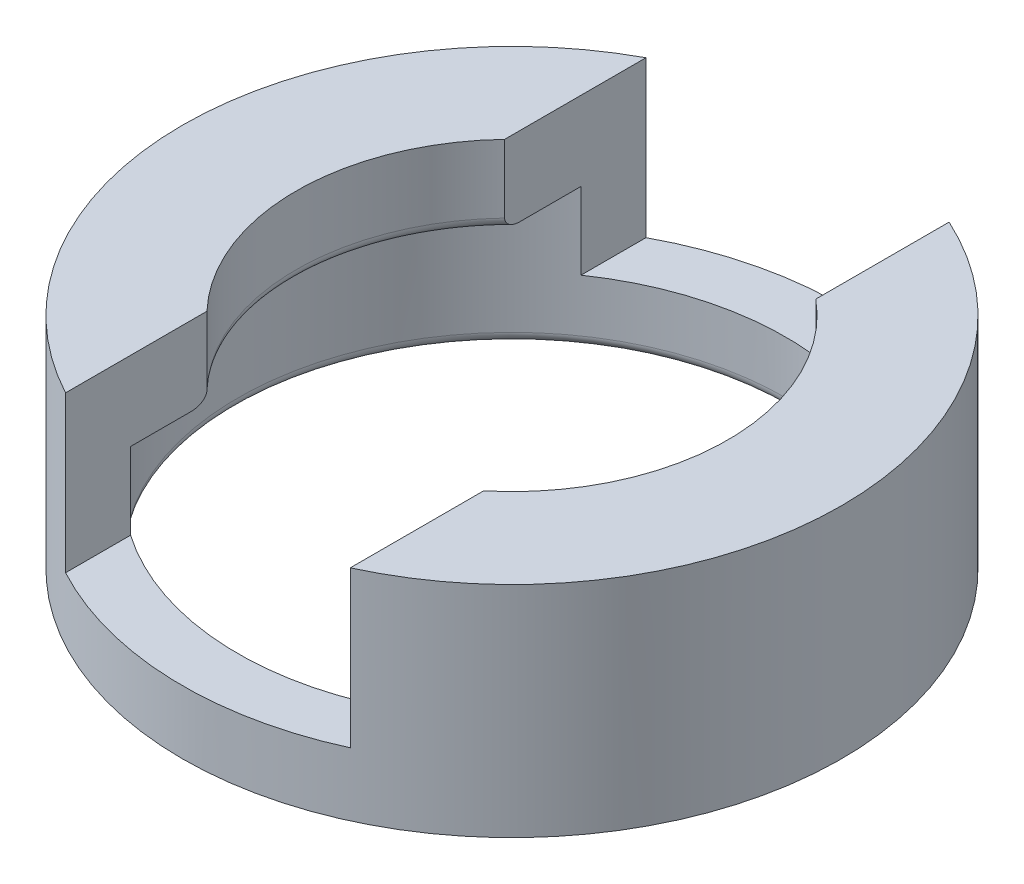
ISO-10303-21;
HEADER;
FILE_DESCRIPTION(('STEP AP214'),'2;1');
FILE_NAME('part.step','',(''),(''),'','','');
FILE_SCHEMA(('AUTOMOTIVE_DESIGN { 1 0 10303 214 1 1 1 1 }'));
ENDSEC;
DATA;
#1=APPLICATION_CONTEXT('core data for automotive mechanical design processes');
#2=APPLICATION_PROTOCOL_DEFINITION('international standard','automotive_design',2000,#1);
#3=PRODUCT_CONTEXT('',#1,'mechanical');
#4=PRODUCT('Part','Part','',(#3));
#5=PRODUCT_RELATED_PRODUCT_CATEGORY('part','',(#4));
#6=PRODUCT_DEFINITION_FORMATION('','',#4);
#7=PRODUCT_DEFINITION_CONTEXT('part definition',#1,'design');
#8=PRODUCT_DEFINITION('design','',#6,#7);
#9=PRODUCT_DEFINITION_SHAPE('','',#8);
#10=(LENGTH_UNIT() NAMED_UNIT(*) SI_UNIT(.MILLI.,.METRE.));
#11=(NAMED_UNIT(*) PLANE_ANGLE_UNIT() SI_UNIT($,.RADIAN.));
#12=(NAMED_UNIT(*) SI_UNIT($,.STERADIAN.) SOLID_ANGLE_UNIT());
#13=UNCERTAINTY_MEASURE_WITH_UNIT(LENGTH_MEASURE(1.E-05),#10,'distance_accuracy_value','');
#14=(GEOMETRIC_REPRESENTATION_CONTEXT(3) GLOBAL_UNCERTAINTY_ASSIGNED_CONTEXT((#13)) GLOBAL_UNIT_ASSIGNED_CONTEXT((#10,
#11,#12)) REPRESENTATION_CONTEXT('',''));
#15=CARTESIAN_POINT('',(0.,0.,0.));
#16=DIRECTION('',(0.,0.,1.));
#17=DIRECTION('',(1.,0.,0.));
#18=AXIS2_PLACEMENT_3D('',#15,#16,#17);
#19=CARTESIAN_POINT('',(0.,20.32,0.));
#20=DIRECTION('',(0.,1.,0.));
#21=DIRECTION('',(0.,0.,1.));
#22=AXIS2_PLACEMENT_3D('',#19,#20,#21);
#23=PLANE('',#22);
#24=DIRECTION('',(0.,0.,1.));
#25=VECTOR('',#24,1.);
#26=CARTESIAN_POINT('',(-14.4791563378845,20.32,0.));
#27=LINE('',#26,#25);
#28=CARTESIAN_POINT('',(-14.4791563378845,20.32,-26.9008648883842));
#29=VERTEX_POINT('',#28);
#30=CARTESIAN_POINT('',(-14.4791563378845,20.32,-13.7968848564848));
#31=VERTEX_POINT('',#30);
#32=EDGE_CURVE('E217',#29,#31,#27,.T.);
#33=ORIENTED_EDGE('',*,*,#32,.F.);
#34=CARTESIAN_POINT('',(0.,20.32,0.));
#35=DIRECTION('',(0.,1.,0.));
#36=DIRECTION('',(0.,0.,1.));
#37=AXIS2_PLACEMENT_3D('',#34,#35,#36);
#38=CIRCLE('',#37,30.55);
#39=CARTESIAN_POINT('',(-14.4791563378845,20.32,26.9008648883842));
#40=VERTEX_POINT('',#39);
#41=EDGE_CURVE('E242',#29,#40,#38,.T.);
#42=ORIENTED_EDGE('',*,*,#41,.T.);
#43=CARTESIAN_POINT('',(-14.4791563378845,20.32,13.7968848564848));
#44=VERTEX_POINT('',#43);
#45=EDGE_CURVE('E213',#44,#40,#27,.T.);
#46=ORIENTED_EDGE('',*,*,#45,.F.);
#47=CARTESIAN_POINT('',(0.,20.32,0.));
#48=DIRECTION('',(0.,1.,0.));
#49=DIRECTION('',(0.,0.,1.));
#50=AXIS2_PLACEMENT_3D('',#47,#48,#49);
#51=CIRCLE('',#50,20.);
#52=EDGE_CURVE('E236',#31,#44,#51,.T.);
#53=ORIENTED_EDGE('',*,*,#52,.F.);
#54=EDGE_LOOP('',(#33,#42,#46,#53));
#55=FACE_BOUND('',#54,.T.);
#56=ADVANCED_FACE('F38',(#55),#23,.T.);
#57=CARTESIAN_POINT('',(0.,13.,0.));
#58=DIRECTION('',(0.,-1.,0.));
#59=DIRECTION('',(0.,0.,-1.));
#60=AXIS2_PLACEMENT_3D('',#57,#58,#59);
#61=PLANE('',#60);
#62=DIRECTION('',(0.,0.,-1.));
#63=VECTOR('',#62,1.);
#64=CARTESIAN_POINT('',(-14.4791563378845,13.,0.));
#65=LINE('',#64,#63);
#66=CARTESIAN_POINT('',(-14.4791563378845,13.,20.8738412311462));
#67=VERTEX_POINT('',#66);
#68=CARTESIAN_POINT('',(-14.4791563378845,13.,15.2103264837774));
#69=VERTEX_POINT('',#68);
#70=EDGE_CURVE('E205',#67,#69,#65,.T.);
#71=ORIENTED_EDGE('',*,*,#70,.F.);
#72=CARTESIAN_POINT('',(0.,13.,0.));
#73=DIRECTION('',(0.,-1.,0.));
#74=DIRECTION('',(0.,0.,-1.));
#75=AXIS2_PLACEMENT_3D('',#72,#73,#74);
#76=CIRCLE('',#75,25.404);
#77=CARTESIAN_POINT('',(-14.4791563378845,13.,-20.8738412311462));
#78=VERTEX_POINT('',#77);
#79=EDGE_CURVE('E235',#67,#78,#76,.T.);
#80=ORIENTED_EDGE('',*,*,#79,.T.);
#81=CARTESIAN_POINT('',(-14.4791563378845,13.,-15.2103264837774));
#82=VERTEX_POINT('',#81);
#83=EDGE_CURVE('E209',#82,#78,#65,.T.);
#84=ORIENTED_EDGE('',*,*,#83,.F.);
#85=CARTESIAN_POINT('',(0.,13.,0.));
#86=DIRECTION('',(0.,-1.,0.));
#87=DIRECTION('',(0.,0.,-1.));
#88=AXIS2_PLACEMENT_3D('',#85,#86,#87);
#89=CIRCLE('',#88,21.);
#90=EDGE_CURVE('E264',#82,#69,#89,.F.);
#91=ORIENTED_EDGE('',*,*,#90,.T.);
#92=EDGE_LOOP('',(#71,#80,#84,#91));
#93=FACE_BOUND('',#92,.T.);
#94=ADVANCED_FACE('F352',(#93),#61,.T.);
#95=CARTESIAN_POINT('',(0.,0.,0.));
#96=DIRECTION('',(0.,1.,0.));
#97=DIRECTION('',(0.,0.,1.));
#98=AXIS2_PLACEMENT_3D('',#95,#96,#97);
#99=CYLINDRICAL_SURFACE('',#98,20.);
#100=ORIENTED_EDGE('',*,*,#52,.T.);
#101=DIRECTION('',(0.,1.,0.));
#102=VECTOR('',#101,1.);
#103=CARTESIAN_POINT('',(-14.4791563378845,0.,13.7968848564848));
#104=LINE('',#103,#102);
#105=CARTESIAN_POINT('',(-14.4791563378845,14.,13.7968848564848));
#106=VERTEX_POINT('',#105);
#107=EDGE_CURVE('E164',#44,#106,#104,.F.);
#108=ORIENTED_EDGE('',*,*,#107,.T.);
#109=CARTESIAN_POINT('',(0.,14.,0.));
#110=DIRECTION('',(0.,-1.,0.));
#111=DIRECTION('',(0.,0.,-1.));
#112=AXIS2_PLACEMENT_3D('',#109,#110,#111);
#113=CIRCLE('',#112,20.);
#114=CARTESIAN_POINT('',(-14.4791563378845,14.,-13.7968848564848));
#115=VERTEX_POINT('',#114);
#116=EDGE_CURVE('E258',#106,#115,#113,.T.);
#117=ORIENTED_EDGE('',*,*,#116,.T.);
#118=DIRECTION('',(0.,1.,0.));
#119=VECTOR('',#118,1.);
#120=CARTESIAN_POINT('',(-14.4791563378845,0.,-13.7968848564848));
#121=LINE('',#120,#119);
#122=EDGE_CURVE('E221',#115,#31,#121,.T.);
#123=ORIENTED_EDGE('',*,*,#122,.T.);
#124=EDGE_LOOP('',(#100,#108,#117,#123));
#125=FACE_BOUND('',#124,.T.);
#126=ADVANCED_FACE('F336',(#125),#99,.F.);
#127=CARTESIAN_POINT('',(0.,14.,0.));
#128=DIRECTION('',(0.,-1.,0.));
#129=DIRECTION('',(0.,0.,-1.));
#130=AXIS2_PLACEMENT_3D('',#127,#128,#129);
#131=TOROIDAL_SURFACE('',#130,21.,1.);
#132=CARTESIAN_POINT('',(-14.4791563378845,13.6482844990715,-16.4786777231464));
#133=CARTESIAN_POINT('',(-14.4791563378845,13.6874067198237,-16.4982403616322));
#134=CARTESIAN_POINT('',(-14.4791563378845,13.7280672099025,-16.51482418904));
#135=CARTESIAN_POINT('',(-14.4791563378845,13.811618218959,-16.5410983668061));
#136=CARTESIAN_POINT('',(-14.4791563378845,13.8545111943468,-16.5507809439679));
#137=CARTESIAN_POINT('',(-14.4791563378845,13.9414392431916,-16.5626278633632));
#138=CARTESIAN_POINT('',(-14.4791563378845,13.9854766873981,-16.5647750956144));
#139=CARTESIAN_POINT('',(-14.4791563378845,14.0732328555154,-16.5613517766027));
#140=CARTESIAN_POINT('',(-14.4791563378845,14.1169516748672,-16.5557836406864));
#141=CARTESIAN_POINT('',(-14.4791563378845,14.2014508735722,-16.537601466612));
#142=CARTESIAN_POINT('',(-14.4791563378845,14.2422803614842,-16.5252122255809));
#143=CARTESIAN_POINT('',(-14.4791563378845,14.3215095873525,-16.4942528369585));
#144=CARTESIAN_POINT('',(-14.4791563378845,14.3599086189755,-16.4756809022947));
#145=CARTESIAN_POINT('',(-14.4791563378845,14.4365917345616,-16.4315291478672));
#146=CARTESIAN_POINT('',(-14.4791563378845,14.4746192918101,-16.4055065433288));
#147=CARTESIAN_POINT('',(-14.4791563378845,14.5466499680347,-16.3484118226484));
#148=CARTESIAN_POINT('',(-14.4791563378845,14.580650608614,-16.3173366244757));
#149=CARTESIAN_POINT('',(-14.4791563378845,14.660489300946,-16.2345382946517));
#150=CARTESIAN_POINT('',(-14.4791563378845,14.7037068847551,-16.1802783971328));
#151=CARTESIAN_POINT('',(-14.4791563378845,14.7808341564161,-16.0654829511519));
#152=CARTESIAN_POINT('',(-14.4791563378845,14.8147220694519,-16.0049331682483));
#153=CARTESIAN_POINT('',(-14.4791563378845,14.8829780640407,-15.8597334356274));
#154=CARTESIAN_POINT('',(-14.4791563378845,14.9140690961675,-15.7735446266392));
#155=CARTESIAN_POINT('',(-14.4791563378845,14.9619173708408,-15.5973750444318));
#156=CARTESIAN_POINT('',(-14.4791563378845,14.9786682024648,-15.5073925940711));
#157=CARTESIAN_POINT('',(-14.4791563378845,14.9989024038299,-15.3243333794709));
#158=CARTESIAN_POINT('',(-14.4791563378845,15.0021413461478,-15.2312300738551));
#159=CARTESIAN_POINT('',(-14.4791563378845,14.9951436284588,-15.0454301776455));
#160=CARTESIAN_POINT('',(-14.4791563378845,14.9848895918245,-14.9527342660578));
#161=CARTESIAN_POINT('',(-14.4791563378845,14.9482788450356,-14.7559111909));
#162=CARTESIAN_POINT('',(-14.4791563378845,14.9197137846948,-14.6521850998215));
#163=CARTESIAN_POINT('',(-14.4791563378845,14.8437128933262,-14.4518778680669));
#164=CARTESIAN_POINT('',(-14.4791563378845,14.796328194759,-14.3552782014846));
#165=CARTESIAN_POINT('',(-14.4791563378845,14.7063315961292,-14.214768309941));
#166=CARTESIAN_POINT('',(-14.4791563378845,14.6707431005037,-14.1663325556815));
#167=CARTESIAN_POINT('',(-14.4791563378845,14.5927365312726,-14.0752931417114));
#168=CARTESIAN_POINT('',(-14.4791563378845,14.5503295626282,-14.0326802039087));
#169=CARTESIAN_POINT('',(-14.4791563378845,14.4680883133954,-13.963536784431));
#170=CARTESIAN_POINT('',(-14.4791563378845,14.4295255462623,-13.9355018285339));
#171=CARTESIAN_POINT('',(-14.4791563378845,14.3483469610957,-13.8860469521597));
#172=CARTESIAN_POINT('',(-14.4791563378845,14.3057360454194,-13.8646191606007));
#173=CARTESIAN_POINT('',(-14.4791563378845,14.2240691204637,-13.8326042606155));
#174=CARTESIAN_POINT('',(-14.4791563378845,14.1854697027085,-13.8208587738898));
#175=CARTESIAN_POINT('',(-14.4791563378845,14.1068406469133,-13.8040343459594));
#176=CARTESIAN_POINT('',(-14.4791563378845,14.0668118874166,-13.7989513797054));
#177=CARTESIAN_POINT('',(-14.4791563378845,13.9864032420779,-13.7958447673766));
#178=CARTESIAN_POINT('',(-14.4791563378845,13.9460228430019,-13.7978342210733));
#179=CARTESIAN_POINT('',(-14.4791563378845,13.8662115376351,-13.8087389847711));
#180=CARTESIAN_POINT('',(-14.4791563378845,13.8267809319868,-13.8176564587841));
#181=CARTESIAN_POINT('',(-14.4791563378845,13.7506606661724,-13.8415198627299));
#182=CARTESIAN_POINT('',(-14.4791563378845,13.7139326426405,-13.8563453310028));
#183=CARTESIAN_POINT('',(-14.4791563378845,13.6430233021189,-13.8911422773452));
#184=CARTESIAN_POINT('',(-14.4791563378845,13.6088431187879,-13.9111160287246));
#185=CARTESIAN_POINT('',(-14.4791563378845,13.5276386385866,-13.9659298503107));
#186=CARTESIAN_POINT('',(-14.4791563378845,13.48232221014,-14.0033042480086));
#187=CARTESIAN_POINT('',(-14.4791563378845,13.3982559297959,-14.0848329147936));
#188=CARTESIAN_POINT('',(-14.4791563378845,13.3595219034027,-14.129003050212));
#189=CARTESIAN_POINT('',(-14.4791563378845,13.2743127867153,-14.2407408487243));
#190=CARTESIAN_POINT('',(-14.4791563378845,13.2308848891615,-14.3106278135442));
#191=CARTESIAN_POINT('',(-14.4791563378845,13.1556524155327,-14.4563424187934));
#192=CARTESIAN_POINT('',(-14.4791563378845,13.1238645447031,-14.5321784090774));
#193=CARTESIAN_POINT('',(-14.4791563378845,13.0639626945836,-14.7088733892199));
#194=CARTESIAN_POINT('',(-14.4791563378845,13.0392500892477,-14.8108887656817));
#195=CARTESIAN_POINT('',(-14.4791563378845,13.006838993818,-15.0176192134497));
#196=CARTESIAN_POINT('',(-14.4791563378845,12.9991579693985,-15.1223369447984));
#197=CARTESIAN_POINT('',(-14.4791563378845,13.0009939792841,-15.3323519021911));
#198=CARTESIAN_POINT('',(-14.4791563378845,13.0106269459525,-15.4376482928581));
#199=CARTESIAN_POINT('',(-14.4791563378845,13.048283856993,-15.6448728556571));
#200=CARTESIAN_POINT('',(-14.4791563378845,13.0762712773678,-15.7468072956019));
#201=CARTESIAN_POINT('',(-14.4791563378845,13.1399365711693,-15.9114267986972));
#202=CARTESIAN_POINT('',(-14.4791563378845,13.1702519819018,-15.9761972909411));
#203=CARTESIAN_POINT('',(-14.4791563378845,13.2406480546415,-16.1002781931477));
#204=CARTESIAN_POINT('',(-14.4791563378845,13.2807205853504,-16.159593093224));
#205=CARTESIAN_POINT('',(-14.4791563378845,13.3612854787075,-16.2581913377405));
#206=CARTESIAN_POINT('',(-14.4791563378845,13.3998532440814,-16.299045174362));
#207=CARTESIAN_POINT('',(-14.4791563378845,13.4830567201777,-16.3738779731274));
#208=CARTESIAN_POINT('',(-14.4791563378845,13.5276697974582,-16.4078814548935));
#209=CARTESIAN_POINT('',(-14.4791563378845,13.5987478580242,-16.4523666012755));
#210=CARTESIAN_POINT('',(-14.4791563378845,13.6231999747172,-16.4661344811705));
#211=CARTESIAN_POINT('',(-14.4791563378845,13.6482844990715,-16.4786777231464));
#212=B_SPLINE_CURVE_WITH_KNOTS('',3,(#132,#133,#134,#135,#136,#137,#138,#139,#140,#141,#142,
#143,#144,#145,#146,#147,#148,#149,#150,#151,#152,#153,#154,#155,#156,#157,#158,#159,#160,#161,
#162,#163,#164,#165,#166,#167,#168,#169,#170,#171,#172,#173,#174,#175,#176,#177,#178,#179,#180,
#181,#182,#183,#184,#185,#186,#187,#188,#189,#190,#191,#192,#193,#194,#195,#196,#197,#198,#199,
#200,#201,#202,#203,#204,#205,#206,#207,#208,#209,#210,#211),.UNSPECIFIED.,.T.,.F.,(4,2,2,2,2,2,
2,2,2,2,2,2,2,2,2,2,2,2,2,2,2,2,2,2,2,2,2,2,2,2,2,2,2,2,2,2,2,2,2,4),(0.,0.131144324541029,
0.262436130548539,0.39402585949961,0.52557440272652,0.653026732297122,0.780515933269723,
0.918236345716962,1.05604108357568,1.26299011309905,1.47041813002982,1.74383641936579,
2.01737687920181,2.29584473220965,2.57467155494657,2.8958296681258,3.21612110781093,
3.39592087226664,3.57543071656629,3.71793858808155,3.86027602886049,3.98079068196239,
4.10123249456328,4.22189750963739,4.34260023036844,4.46095841307251,4.57936894859848,
4.75460425658589,4.93025508362805,5.17575794478517,5.42161177242166,5.73492531686711,
6.04856001214743,6.3643025962633,6.67941877484999,6.89326020093183,7.10692402413726,
7.27486875535216,7.44220123891214,7.526288822378),.UNSPECIFIED.);
#213=EDGE_CURVE('E302',#115,#82,#212,.T.);
#214=ORIENTED_EDGE('',*,*,#213,.F.);
#215=ORIENTED_EDGE('',*,*,#116,.F.);
#216=CARTESIAN_POINT('',(-14.4791563378845,13.7292537586572,13.8509709615593));
#217=CARTESIAN_POINT('',(-14.4791563378845,13.7665923801467,13.8357836204923));
#218=CARTESIAN_POINT('',(-14.4791563378845,13.8051530238382,13.8234860029984));
#219=CARTESIAN_POINT('',(-14.4791563378845,13.8838415264897,13.8055393999995));
#220=CARTESIAN_POINT('',(-14.4791563378845,13.923970865351,13.7998968572861));
#221=CARTESIAN_POINT('',(-14.4791563378845,14.0046697656275,13.7957188130373));
#222=CARTESIAN_POINT('',(-14.4791563378845,14.0452399085209,13.7971942406337));
#223=CARTESIAN_POINT('',(-14.4791563378845,14.1254906945057,13.8071573190403));
#224=CARTESIAN_POINT('',(-14.4791563378845,14.1651714065857,13.8156444240445));
#225=CARTESIAN_POINT('',(-14.4791563378845,14.2416040249363,13.8386885407864));
#226=CARTESIAN_POINT('',(-14.4791563378845,14.2784046093422,13.8530867024141));
#227=CARTESIAN_POINT('',(-14.4791563378845,14.3495081168163,13.887071319144));
#228=CARTESIAN_POINT('',(-14.4791563378845,14.3838097552737,13.9066604190446));
#229=CARTESIAN_POINT('',(-14.4791563378845,14.4650058365623,13.9603479869937));
#230=CARTESIAN_POINT('',(-14.4791563378845,14.5102533822647,13.9969409493431));
#231=CARTESIAN_POINT('',(-14.4791563378845,14.5943009043205,14.0769100288275));
#232=CARTESIAN_POINT('',(-14.4791563378845,14.633085616523,14.1203017477532));
#233=CARTESIAN_POINT('',(-14.4791563378845,14.7185255921437,14.2301837498719));
#234=CARTESIAN_POINT('',(-14.4791563378845,14.7621829247515,14.2990004190458));
#235=CARTESIAN_POINT('',(-14.4791563378845,14.8380453436944,14.4426238703053));
#236=CARTESIAN_POINT('',(-14.4791563378845,14.8702336299123,14.5174392446556));
#237=CARTESIAN_POINT('',(-14.4791563378845,14.9314430440656,14.6924640188912));
#238=CARTESIAN_POINT('',(-14.4791563378845,14.9570105793838,14.7938843544572));
#239=CARTESIAN_POINT('',(-14.4791563378845,14.9912358209897,14.9995627875123));
#240=CARTESIAN_POINT('',(-14.4791563378845,14.9998765927621,15.1038236212061));
#241=CARTESIAN_POINT('',(-14.4791563378845,15.0001217107009,15.3131483437949));
#242=CARTESIAN_POINT('',(-14.4791563378845,14.9916015170001,15.4182125509095));
#243=CARTESIAN_POINT('',(-14.4791563378845,14.9563603160452,15.625231554833));
#244=CARTESIAN_POINT('',(-14.4791563378845,14.9296708736482,15.727191424299));
#245=CARTESIAN_POINT('',(-14.4791563378845,14.8679732730399,15.8932579361088));
#246=CARTESIAN_POINT('',(-14.4791563378845,14.8381198207835,15.9592894517643));
#247=CARTESIAN_POINT('',(-14.4791563378845,14.7684571004054,16.0859003094814));
#248=CARTESIAN_POINT('',(-14.4791563378845,14.7286624876144,16.1464875003942));
#249=CARTESIAN_POINT('',(-14.4791563378845,14.6487217037245,16.2469323371324));
#250=CARTESIAN_POINT('',(-14.4791563378845,14.6106123641981,16.2884068017039));
#251=CARTESIAN_POINT('',(-14.4791563378845,14.5281968690779,16.3646923712859));
#252=CARTESIAN_POINT('',(-14.4791563378845,14.4838981960292,16.39951140372));
#253=CARTESIAN_POINT('',(-14.4791563378845,14.3978004733137,16.4552349071336));
#254=CARTESIAN_POINT('',(-14.4791563378845,14.356887437094,16.4775034124783));
#255=CARTESIAN_POINT('',(-14.4791563378845,14.2719152033898,16.5149424103216));
#256=CARTESIAN_POINT('',(-14.4791563378845,14.2278577597695,16.5301168245925));
#257=CARTESIAN_POINT('',(-14.4791563378845,14.1374934482469,16.5524427950441));
#258=CARTESIAN_POINT('',(-14.4791563378845,14.0911763731757,16.5595535794678));
#259=CARTESIAN_POINT('',(-14.4791563378845,13.9980262962591,16.5650745284595));
#260=CARTESIAN_POINT('',(-14.4791563378845,13.9511934269453,16.5634868783029));
#261=CARTESIAN_POINT('',(-14.4791563378845,13.8625792551716,16.5522480419137));
#262=CARTESIAN_POINT('',(-14.4791563378845,13.8207068934496,16.5432936022459));
#263=CARTESIAN_POINT('',(-14.4791563378845,13.738963572497,16.5187687980181));
#264=CARTESIAN_POINT('',(-14.4791563378845,13.6990927866586,16.5031978613881));
#265=CARTESIAN_POINT('',(-14.4791563378845,13.6204671034511,16.4654434245642));
#266=CARTESIAN_POINT('',(-14.4791563378845,13.581838411373,16.4429992117438));
#267=CARTESIAN_POINT('',(-14.4791563378845,13.5081942563584,16.3928356347388));
#268=CARTESIAN_POINT('',(-14.4791563378845,13.4731808165431,16.3651133413142));
#269=CARTESIAN_POINT('',(-14.4791563378845,13.3918189399764,16.2916406556688));
#270=CARTESIAN_POINT('',(-14.4791563378845,13.3476574042568,16.2434605683284));
#271=CARTESIAN_POINT('',(-14.4791563378845,13.2677021640773,16.140580071959));
#272=CARTESIAN_POINT('',(-14.4791563378845,13.231927125944,16.0858655194726));
#273=CARTESIAN_POINT('',(-14.4791563378845,13.1581794887587,15.9534465439887));
#274=CARTESIAN_POINT('',(-14.4791563378845,13.1232614742773,15.8740437051516));
#275=CARTESIAN_POINT('',(-14.4791563378845,13.0666788939422,15.7107358191372));
#276=CARTESIAN_POINT('',(-14.4791563378845,13.0450229834128,15.6268278705285));
#277=CARTESIAN_POINT('',(-14.4791563378845,13.0137666043611,15.4550278421479));
#278=CARTESIAN_POINT('',(-14.4791563378845,13.0044259622187,15.3670892057038));
#279=CARTESIAN_POINT('',(-14.4791563378845,12.9980486306425,15.1907353589878));
#280=CARTESIAN_POINT('',(-14.4791563378845,13.0010213702347,15.1023198352944));
#281=CARTESIAN_POINT('',(-14.4791563378845,13.0208342978026,14.9095499046578));
#282=CARTESIAN_POINT('',(-14.4791563378845,13.0402677690758,14.8054525838155));
#283=CARTESIAN_POINT('',(-14.4791563378845,13.0968706576954,14.6021580242742));
#284=CARTESIAN_POINT('',(-14.4791563378845,13.1340178984048,14.5029548292976));
#285=CARTESIAN_POINT('',(-14.4791563378845,13.2109213596349,14.3471553600798));
#286=CARTESIAN_POINT('',(-14.4791563378845,13.2451793115544,14.2878315895462));
#287=CARTESIAN_POINT('',(-14.4791563378845,13.3222681402873,14.174963348911));
#288=CARTESIAN_POINT('',(-14.4791563378845,13.3650901248986,14.1214129722174));
#289=CARTESIAN_POINT('',(-14.4791563378845,13.4485639997187,14.0344295316681));
#290=CARTESIAN_POINT('',(-14.4791563378845,13.4873649117684,13.9992251254288));
#291=CARTESIAN_POINT('',(-14.4791563378845,13.5700816775171,13.9355948684917));
#292=CARTESIAN_POINT('',(-14.4791563378845,13.6139769161749,13.9071430249341));
#293=CARTESIAN_POINT('',(-14.4791563378845,13.6826341371937,13.8712809103872));
#294=CARTESIAN_POINT('',(-14.4791563378845,13.7057008269177,13.8605510261999));
#295=CARTESIAN_POINT('',(-14.4791563378845,13.7292537586572,13.8509709615593));
#296=B_SPLINE_CURVE_WITH_KNOTS('',3,(#216,#217,#218,#219,#220,#221,#222,#223,#224,#225,#226,
#227,#228,#229,#230,#231,#232,#233,#234,#235,#236,#237,#238,#239,#240,#241,#242,#243,#244,#245,
#246,#247,#248,#249,#250,#251,#252,#253,#254,#255,#256,#257,#258,#259,#260,#261,#262,#263,#264,
#265,#266,#267,#268,#269,#270,#271,#272,#273,#274,#275,#276,#277,#278,#279,#280,#281,#282,#283,
#284,#285,#286,#287,#288,#289,#290,#291,#292,#293,#294,#295),.UNSPECIFIED.,.T.,.F.,(4,2,2,2,2,2,
2,2,2,2,2,2,2,2,2,2,2,2,2,2,2,2,2,2,2,2,2,2,2,2,2,2,2,2,2,2,2,2,2,4),(0.,0.120853519086234,
0.241823940927726,0.362980163220578,0.484126955307726,0.602211549024963,0.720356423257347,
0.893958871031237,1.06796569961209,1.31112696476816,1.55464296771401,1.86683862308401,
2.17934645788729,2.49413038293644,2.80836883478092,3.02505380936611,3.24142121126636,
3.40978450035741,3.57794598139546,3.71711229016734,3.85620157345084,3.99599103477352,
4.13574537891869,4.26362269631776,4.39151107238981,4.52502422354981,4.65861168924823,
4.85359916475069,5.04901660002814,5.30785231628118,5.56685677847512,5.83124261550846,
6.09583094456986,6.41205916517099,6.72789252120253,6.93280299374323,7.1375017981705,
7.29414079485957,7.45016668474895,7.52640020842948),.UNSPECIFIED.);
#297=EDGE_CURVE('E298',#69,#106,#296,.T.);
#298=ORIENTED_EDGE('',*,*,#297,.F.);
#299=ORIENTED_EDGE('',*,*,#90,.F.);
#300=EDGE_LOOP('',(#214,#215,#298,#299));
#301=FACE_BOUND('',#300,.T.);
#302=ADVANCED_FACE('F350',(#301),#131,.T.);
#303=CARTESIAN_POINT('',(0.,20.32,0.));
#304=DIRECTION('',(0.,-1.,0.));
#305=DIRECTION('',(0.,0.,-1.));
#306=AXIS2_PLACEMENT_3D('',#303,#304,#305);
#307=CYLINDRICAL_SURFACE('',#306,30.55);
#308=CARTESIAN_POINT('',(0.,5.87535169593215,0.));
#309=DIRECTION('',(0.,-1.,0.));
#310=DIRECTION('',(0.,0.,-1.));
#311=AXIS2_PLACEMENT_3D('',#308,#309,#310);
#312=CIRCLE('',#311,30.55);
#313=CARTESIAN_POINT('',(-14.4791563378845,5.87535169593215,-26.9008648883842));
#314=VERTEX_POINT('',#313);
#315=CARTESIAN_POINT('',(12.7652970162573,5.87535169593215,-27.7551741498181));
#316=VERTEX_POINT('',#315);
#317=EDGE_CURVE('E141',#314,#316,#312,.T.);
#318=ORIENTED_EDGE('',*,*,#317,.T.);
#319=DIRECTION('',(0.,-1.,0.));
#320=VECTOR('',#319,1.);
#321=CARTESIAN_POINT('',(12.7652970162573,20.32,-27.7551741498181));
#322=LINE('',#321,#320);
#323=CARTESIAN_POINT('',(12.7652970162573,20.32,-27.7551741498181));
#324=VERTEX_POINT('',#323);
#325=EDGE_CURVE('E146',#316,#324,#322,.F.);
#326=ORIENTED_EDGE('',*,*,#325,.T.);
#327=CARTESIAN_POINT('',(12.7652970162573,20.32,27.7551741498181));
#328=VERTEX_POINT('',#327);
#329=EDGE_CURVE('E246',#328,#324,#38,.T.);
#330=ORIENTED_EDGE('',*,*,#329,.F.);
#331=DIRECTION('',(0.,-1.,0.));
#332=VECTOR('',#331,1.);
#333=CARTESIAN_POINT('',(12.7652970162573,20.32,27.7551741498181));
#334=LINE('',#333,#332);
#335=CARTESIAN_POINT('',(12.7652970162573,5.87535169593215,27.7551741498181));
#336=VERTEX_POINT('',#335);
#337=EDGE_CURVE('E191',#328,#336,#334,.T.);
#338=ORIENTED_EDGE('',*,*,#337,.T.);
#339=CARTESIAN_POINT('',(-14.4791563378845,5.87535169593215,26.9008648883842));
#340=VERTEX_POINT('',#339);
#341=EDGE_CURVE('E155',#336,#340,#312,.T.);
#342=ORIENTED_EDGE('',*,*,#341,.T.);
#343=DIRECTION('',(0.,-1.,0.));
#344=VECTOR('',#343,1.);
#345=CARTESIAN_POINT('',(-14.4791563378845,20.32,26.9008648883842));
#346=LINE('',#345,#344);
#347=EDGE_CURVE('E216',#340,#40,#346,.F.);
#348=ORIENTED_EDGE('',*,*,#347,.T.);
#349=ORIENTED_EDGE('',*,*,#41,.F.);
#350=DIRECTION('',(0.,-1.,0.));
#351=VECTOR('',#350,1.);
#352=CARTESIAN_POINT('',(-14.4791563378845,20.32,-26.9008648883842));
#353=LINE('',#352,#351);
#354=EDGE_CURVE('E149',#29,#314,#353,.T.);
#355=ORIENTED_EDGE('',*,*,#354,.T.);
#356=EDGE_LOOP('',(#318,#326,#330,#338,#342,#348,#349,#355));
#357=FACE_BOUND('',#356,.T.);
#358=CARTESIAN_POINT('',(0.,0.,0.));
#359=DIRECTION('',(0.,1.,0.));
#360=DIRECTION('',(0.,0.,1.));
#361=AXIS2_PLACEMENT_3D('',#358,#359,#360);
#362=CIRCLE('',#361,30.55);
#363=CARTESIAN_POINT('',(0.,0.,30.55));
#364=VERTEX_POINT('',#363);
#365=EDGE_CURVE('E241',#364,#364,#362,.T.);
#366=ORIENTED_EDGE('',*,*,#365,.T.);
#367=EDGE_LOOP('',(#366));
#368=FACE_BOUND('',#367,.T.);
#369=ADVANCED_FACE('F143',(#357,#368),#307,.T.);
#370=DIRECTION('',(0.,0.,-1.));
#371=VECTOR('',#370,1.);
#372=CARTESIAN_POINT('',(12.7652970162573,20.32,0.));
#373=LINE('',#372,#371);
#374=CARTESIAN_POINT('',(12.7652970162573,20.32,15.3963369697708));
#375=VERTEX_POINT('',#374);
#376=EDGE_CURVE('E188',#328,#375,#373,.T.);
#377=ORIENTED_EDGE('',*,*,#376,.F.);
#378=ORIENTED_EDGE('',*,*,#329,.T.);
#379=CARTESIAN_POINT('',(12.7652970162573,20.32,-15.3963369697708));
#380=VERTEX_POINT('',#379);
#381=EDGE_CURVE('E162',#380,#324,#373,.T.);
#382=ORIENTED_EDGE('',*,*,#381,.F.);
#383=EDGE_CURVE('E231',#375,#380,#51,.T.);
#384=ORIENTED_EDGE('',*,*,#383,.F.);
#385=EDGE_LOOP('',(#377,#378,#382,#384));
#386=FACE_BOUND('',#385,.T.);
#387=ADVANCED_FACE('F364',(#386),#23,.T.);
#388=CARTESIAN_POINT('',(0.,0.,0.));
#389=DIRECTION('',(0.,1.,0.));
#390=DIRECTION('',(0.,0.,1.));
#391=AXIS2_PLACEMENT_3D('',#388,#389,#390);
#392=PLANE('',#391);
#393=CARTESIAN_POINT('',(0.,0.,0.));
#394=DIRECTION('',(0.,1.,0.));
#395=DIRECTION('',(0.,0.,1.));
#396=AXIS2_PLACEMENT_3D('',#393,#394,#395);
#397=CIRCLE('',#396,26.404);
#398=CARTESIAN_POINT('',(0.,0.,26.404));
#399=VERTEX_POINT('',#398);
#400=EDGE_CURVE('E254',#399,#399,#397,.T.);
#401=ORIENTED_EDGE('',*,*,#400,.T.);
#402=EDGE_LOOP('',(#401));
#403=FACE_BOUND('',#402,.T.);
#404=ORIENTED_EDGE('',*,*,#365,.F.);
#405=EDGE_LOOP('',(#404));
#406=FACE_BOUND('',#405,.T.);
#407=ADVANCED_FACE('F372',(#403,#406),#392,.F.);
#408=CARTESIAN_POINT('',(0.,13.,0.));
#409=DIRECTION('',(0.,-1.,0.));
#410=DIRECTION('',(0.,0.,-1.));
#411=AXIS2_PLACEMENT_3D('',#408,#409,#410);
#412=CYLINDRICAL_SURFACE('',#411,25.404);
#413=ORIENTED_EDGE('',*,*,#79,.F.);
#414=DIRECTION('',(0.,-1.,0.));
#415=VECTOR('',#414,1.);
#416=CARTESIAN_POINT('',(-14.4791563378845,13.,20.8738412311462));
#417=LINE('',#416,#415);
#418=CARTESIAN_POINT('',(-14.4791563378845,5.87535169593215,20.8738412311462));
#419=VERTEX_POINT('',#418);
#420=EDGE_CURVE('E208',#67,#419,#417,.T.);
#421=ORIENTED_EDGE('',*,*,#420,.T.);
#422=CARTESIAN_POINT('',(0.,5.87535169593215,0.));
#423=DIRECTION('',(0.,-1.,0.));
#424=DIRECTION('',(0.,0.,-1.));
#425=AXIS2_PLACEMENT_3D('',#422,#423,#424);
#426=CIRCLE('',#425,25.404);
#427=CARTESIAN_POINT('',(12.7652970162573,5.87535169593215,21.963843199375));
#428=VERTEX_POINT('',#427);
#429=EDGE_CURVE('E11',#419,#428,#426,.F.);
#430=ORIENTED_EDGE('',*,*,#429,.T.);
#431=DIRECTION('',(0.,-1.,0.));
#432=VECTOR('',#431,1.);
#433=CARTESIAN_POINT('',(12.7652970162573,13.,21.963843199375));
#434=LINE('',#433,#432);
#435=CARTESIAN_POINT('',(12.7652970162573,13.,21.963843199375));
#436=VERTEX_POINT('',#435);
#437=EDGE_CURVE('E184',#428,#436,#434,.F.);
#438=ORIENTED_EDGE('',*,*,#437,.T.);
#439=CARTESIAN_POINT('',(12.7652970162573,13.,-21.963843199375));
#440=VERTEX_POINT('',#439);
#441=EDGE_CURVE('E237',#440,#436,#76,.T.);
#442=ORIENTED_EDGE('',*,*,#441,.F.);
#443=DIRECTION('',(0.,-1.,0.));
#444=VECTOR('',#443,1.);
#445=CARTESIAN_POINT('',(12.7652970162573,13.,-21.963843199375));
#446=LINE('',#445,#444);
#447=CARTESIAN_POINT('',(12.7652970162573,5.87535169593215,-21.963843199375));
#448=VERTEX_POINT('',#447);
#449=EDGE_CURVE('E199',#440,#448,#446,.T.);
#450=ORIENTED_EDGE('',*,*,#449,.T.);
#451=CARTESIAN_POINT('',(-14.4791563378845,5.87535169593215,-20.8738412311462));
#452=VERTEX_POINT('',#451);
#453=EDGE_CURVE('E43',#448,#452,#426,.F.);
#454=ORIENTED_EDGE('',*,*,#453,.T.);
#455=DIRECTION('',(0.,-1.,0.));
#456=VECTOR('',#455,1.);
#457=CARTESIAN_POINT('',(-14.4791563378845,13.,-20.8738412311462));
#458=LINE('',#457,#456);
#459=EDGE_CURVE('E225',#452,#78,#458,.F.);
#460=ORIENTED_EDGE('',*,*,#459,.T.);
#461=EDGE_LOOP('',(#413,#421,#430,#438,#442,#450,#454,#460));
#462=FACE_BOUND('',#461,.T.);
#463=CARTESIAN_POINT('',(0.,0.999999999999999,0.));
#464=DIRECTION('',(0.,1.,0.));
#465=DIRECTION('',(0.,0.,1.));
#466=AXIS2_PLACEMENT_3D('',#463,#464,#465);
#467=CIRCLE('',#466,25.404);
#468=CARTESIAN_POINT('',(0.,0.999999999999999,25.404));
#469=VERTEX_POINT('',#468);
#470=EDGE_CURVE('E250',#469,#469,#467,.F.);
#471=ORIENTED_EDGE('',*,*,#470,.T.);
#472=EDGE_LOOP('',(#471));
#473=FACE_BOUND('',#472,.T.);
#474=ADVANCED_FACE('F326',(#462,#473),#412,.F.);
#475=DIRECTION('',(0.,0.,1.));
#476=VECTOR('',#475,1.);
#477=CARTESIAN_POINT('',(12.7652970162573,13.,0.));
#478=LINE('',#477,#476);
#479=CARTESIAN_POINT('',(12.7652970162573,13.,-16.6747471371152));
#480=VERTEX_POINT('',#479);
#481=EDGE_CURVE('E63',#440,#480,#478,.T.);
#482=ORIENTED_EDGE('',*,*,#481,.F.);
#483=ORIENTED_EDGE('',*,*,#441,.T.);
#484=CARTESIAN_POINT('',(12.7652970162573,13.,16.6747471371152));
#485=VERTEX_POINT('',#484);
#486=EDGE_CURVE('E173',#485,#436,#478,.T.);
#487=ORIENTED_EDGE('',*,*,#486,.F.);
#488=EDGE_CURVE('E263',#485,#480,#89,.F.);
#489=ORIENTED_EDGE('',*,*,#488,.T.);
#490=EDGE_LOOP('',(#482,#483,#487,#489));
#491=FACE_BOUND('',#490,.T.);
#492=ADVANCED_FACE('F322',(#491),#61,.T.);
#493=ORIENTED_EDGE('',*,*,#383,.T.);
#494=DIRECTION('',(0.,1.,0.));
#495=VECTOR('',#494,1.);
#496=CARTESIAN_POINT('',(12.7652970162573,0.,-15.3963369697708));
#497=LINE('',#496,#495);
#498=CARTESIAN_POINT('',(12.7652970162573,14.,-15.3963369697708));
#499=VERTEX_POINT('',#498);
#500=EDGE_CURVE('E195',#380,#499,#497,.F.);
#501=ORIENTED_EDGE('',*,*,#500,.T.);
#502=CARTESIAN_POINT('',(12.7652970162573,14.,15.3963369697708));
#503=VERTEX_POINT('',#502);
#504=EDGE_CURVE('E259',#499,#503,#113,.T.);
#505=ORIENTED_EDGE('',*,*,#504,.T.);
#506=DIRECTION('',(0.,1.,0.));
#507=VECTOR('',#506,1.);
#508=CARTESIAN_POINT('',(12.7652970162573,0.,15.3963369697708));
#509=LINE('',#508,#507);
#510=EDGE_CURVE('E55',#503,#375,#509,.T.);
#511=ORIENTED_EDGE('',*,*,#510,.T.);
#512=EDGE_LOOP('',(#493,#501,#505,#511));
#513=FACE_BOUND('',#512,.T.);
#514=ADVANCED_FACE('F295',(#513),#99,.F.);
#515=CARTESIAN_POINT('',(0.,0.999999999999999,0.));
#516=DIRECTION('',(0.,1.,0.));
#517=DIRECTION('',(0.,0.,1.));
#518=AXIS2_PLACEMENT_3D('',#515,#516,#517);
#519=TOROIDAL_SURFACE('',#518,26.404,1.);
#520=ORIENTED_EDGE('',*,*,#400,.F.);
#521=EDGE_LOOP('',(#520));
#522=FACE_BOUND('',#521,.T.);
#523=ORIENTED_EDGE('',*,*,#470,.F.);
#524=EDGE_LOOP('',(#523));
#525=FACE_BOUND('',#524,.T.);
#526=ADVANCED_FACE('F371',(#522,#525),#519,.T.);
#527=CARTESIAN_POINT('',(12.7652970162573,13.62149003991,-17.8263570438858));
#528=CARTESIAN_POINT('',(12.7652970162573,13.5696946980577,-17.8002971582877));
#529=CARTESIAN_POINT('',(12.7652970162573,13.5203500218271,-17.7691856100845));
#530=CARTESIAN_POINT('',(12.7652970162573,13.4278176864843,-17.6987229816796));
#531=CARTESIAN_POINT('',(12.7652970162573,13.3846529301765,-17.6593425217238));
#532=CARTESIAN_POINT('',(12.7652970162573,13.3055019592268,-17.5745901134725));
#533=CARTESIAN_POINT('',(12.7652970162573,13.2694589915696,-17.529270756335));
#534=CARTESIAN_POINT('',(12.7652970162573,13.2042963490475,-17.433996075896));
#535=CARTESIAN_POINT('',(12.7652970162573,13.1751723635927,-17.3840436661466));
#536=CARTESIAN_POINT('',(12.7652970162573,13.1196513448846,-17.2725238393858));
#537=CARTESIAN_POINT('',(12.7652970162573,13.0944273792123,-17.210373625176));
#538=CARTESIAN_POINT('',(12.7652970162573,13.0529215887125,-17.0831549128855));
#539=CARTESIAN_POINT('',(12.7652970162573,13.0366466309053,-17.0180842150679));
#540=CARTESIAN_POINT('',(12.7652970162573,13.0105759987198,-16.8740531075125));
#541=CARTESIAN_POINT('',(12.7652970162573,13.0025581218443,-16.794768331339));
#542=CARTESIAN_POINT('',(12.7652970162573,12.9984802990463,-16.6358455747334));
#543=CARTESIAN_POINT('',(12.7652970162573,13.0024324173533,-16.5562073187895));
#544=CARTESIAN_POINT('',(12.7652970162573,13.023295833519,-16.3895674515731));
#545=CARTESIAN_POINT('',(12.7652970162573,13.0416048516247,-16.3027365510655));
#546=CARTESIAN_POINT('',(12.7652970162573,13.093026229803,-16.1335499542412));
#547=CARTESIAN_POINT('',(12.7652970162573,13.1261263470194,-16.0511906198296));
#548=CARTESIAN_POINT('',(12.7652970162573,13.1972158019437,-15.9140599361531));
#549=CARTESIAN_POINT('',(12.7652970162573,13.2318808899316,-15.8575602348296));
#550=CARTESIAN_POINT('',(12.7652970162573,13.3098134071135,-15.7508431598079));
#551=CARTESIAN_POINT('',(12.7652970162573,13.3530671173075,-15.7006159725201));
#552=CARTESIAN_POINT('',(12.7652970162573,13.4384029571928,-15.618148238172));
#553=CARTESIAN_POINT('',(12.7652970162573,13.4789511591966,-15.5843246659024));
#554=CARTESIAN_POINT('',(12.7652970162573,13.5650527215874,-15.5237162557173));
#555=CARTESIAN_POINT('',(12.7652970162573,13.6106041489971,-15.4969287129289));
#556=CARTESIAN_POINT('',(12.7652970162573,13.7062711513999,-15.4518317499095));
#557=CARTESIAN_POINT('',(12.7652970162573,13.7564229493503,-15.4335980283572));
#558=CARTESIAN_POINT('',(12.7652970162573,13.8593476960945,-15.407455108737));
#559=CARTESIAN_POINT('',(12.7652970162573,13.9121177091341,-15.3995346066144));
#560=CARTESIAN_POINT('',(12.7652970162573,14.0105092709923,-15.3950659527877));
#561=CARTESIAN_POINT('',(12.7652970162573,14.0560689719189,-15.397047833831));
#562=CARTESIAN_POINT('',(12.7652970162573,14.1461338323839,-15.4089368635341));
#563=CARTESIAN_POINT('',(12.7652970162573,14.1906390623054,-15.418843481696));
#564=CARTESIAN_POINT('',(12.7652970162573,14.2758706296947,-15.4454606033908));
#565=CARTESIAN_POINT('',(12.7652970162573,14.3166740176529,-15.4619281616622));
#566=CARTESIAN_POINT('',(12.7652970162573,14.3953418095096,-15.5007698449017));
#567=CARTESIAN_POINT('',(12.7652970162573,14.4332056345181,-15.5231451294836));
#568=CARTESIAN_POINT('',(12.7652970162573,14.5097783750418,-15.5758066180842));
#569=CARTESIAN_POINT('',(12.7652970162573,14.5480569134918,-15.6067156896513));
#570=CARTESIAN_POINT('',(12.7652970162573,14.6199866777328,-15.6735090909664));
#571=CARTESIAN_POINT('',(12.7652970162573,14.6536337967426,-15.7093977803546));
#572=CARTESIAN_POINT('',(12.7652970162573,14.7314543777601,-15.8035684066351));
#573=CARTESIAN_POINT('',(12.7652970162573,14.7727571164747,-15.8642345614115));
#574=CARTESIAN_POINT('',(12.7652970162573,14.8449488726238,-15.9914707582569));
#575=CARTESIAN_POINT('',(12.7652970162573,14.8758219687842,-16.0580496324392));
#576=CARTESIAN_POINT('',(12.7652970162573,14.9276928759907,-16.1959321669146));
#577=CARTESIAN_POINT('',(12.7652970162573,14.9485542175774,-16.2672867977038));
#578=CARTESIAN_POINT('',(12.7652970162573,14.9799410980269,-16.4122054431344));
#579=CARTESIAN_POINT('',(12.7652970162573,14.9904661445493,-16.4857695628466));
#580=CARTESIAN_POINT('',(12.7652970162573,15.0021216393897,-16.6464352167621));
#581=CARTESIAN_POINT('',(12.7652970162573,15.0013184879698,-16.7336831029607));
#582=CARTESIAN_POINT('',(12.7652970162573,14.9852390597404,-16.9068844850365));
#583=CARTESIAN_POINT('',(12.7652970162573,14.9699616412712,-16.992837878267));
#584=CARTESIAN_POINT('',(12.7652970162573,14.9279707043861,-17.1477282168989));
#585=CARTESIAN_POINT('',(12.7652970162573,14.903388130688,-17.2172428338242));
#586=CARTESIAN_POINT('',(12.7652970162573,14.84320199969,-17.3513324009548));
#587=CARTESIAN_POINT('',(12.7652970162573,14.8076120270683,-17.4159133182001));
#588=CARTESIAN_POINT('',(12.7652970162573,14.7330327802788,-17.5261256436895));
#589=CARTESIAN_POINT('',(12.7652970162573,14.6959381243279,-17.5730377550661));
#590=CARTESIAN_POINT('',(12.7652970162573,14.6145717737777,-17.6601829867689));
#591=CARTESIAN_POINT('',(12.7652970162573,14.5703075400184,-17.7004229631262));
#592=CARTESIAN_POINT('',(12.7652970162573,14.4823875642939,-17.7668533535715));
#593=CARTESIAN_POINT('',(12.7652970162573,14.4396429246816,-17.7942467941152));
#594=CARTESIAN_POINT('',(12.7652970162573,14.3501771590854,-17.8415481033802));
#595=CARTESIAN_POINT('',(12.7652970162573,14.3034580192373,-17.8614596842981));
#596=CARTESIAN_POINT('',(12.7652970162573,14.2069797081672,-17.8927654987999));
#597=CARTESIAN_POINT('',(12.7652970162573,14.1572073750881,-17.9041195762548));
#598=CARTESIAN_POINT('',(12.7652970162573,14.0563967078253,-17.9174135122321));
#599=CARTESIAN_POINT('',(12.7652970162573,14.0053582984172,-17.919352810018));
#600=CARTESIAN_POINT('',(12.7652970162573,13.9082082668947,-17.9139381158572));
#601=CARTESIAN_POINT('',(12.7652970162573,13.8620501208455,-17.9073683045091));
#602=CARTESIAN_POINT('',(12.7652970162573,13.7715451793159,-17.8866417294822));
#603=CARTESIAN_POINT('',(12.7652970162573,13.7271952294518,-17.8724988450121));
#604=CARTESIAN_POINT('',(12.7652970162573,13.6629943877747,-17.8462490320047));
#605=CARTESIAN_POINT('',(12.7652970162573,13.642049158581,-17.8367009910711));
#606=CARTESIAN_POINT('',(12.7652970162573,13.62149003991,-17.8263570438858));
#607=B_SPLINE_CURVE_WITH_KNOTS('',3,(#527,#528,#529,#530,#531,#532,#533,#534,#535,#536,#537,
#538,#539,#540,#541,#542,#543,#544,#545,#546,#547,#548,#549,#550,#551,#552,#553,#554,#555,#556,
#557,#558,#559,#560,#561,#562,#563,#564,#565,#566,#567,#568,#569,#570,#571,#572,#573,#574,#575,
#576,#577,#578,#579,#580,#581,#582,#583,#584,#585,#586,#587,#588,#589,#590,#591,#592,#593,#594,
#595,#596,#597,#598,#599,#600,#601,#602,#603,#604,#605,#606),.UNSPECIFIED.,.T.,.F.,(4,2,2,2,2,2,
2,2,2,2,2,2,2,2,2,2,2,2,2,2,2,2,2,2,2,2,2,2,2,2,2,2,2,2,2,2,2,2,2,4),(0.,0.173869218390533,
0.348366983085755,0.521412507255528,0.694349938068823,0.894830533173041,1.09546475311214,
1.33357049727796,1.57191630151663,1.83687526723136,2.10161532675588,2.29976153758809,
2.49759375029874,2.65539520538874,2.81313590751125,2.97224739226066,3.13118433178898,
3.26729397687147,3.40339451126358,3.53486469519596,3.66636070431092,3.8134200021456,
3.96060887201576,4.17959106303107,4.39890604447877,4.62113108744869,4.84336671497037,
5.103935354504,5.3645245481375,5.58486252640031,5.80492965443378,5.98365489051154,
6.1621953216901,6.31386423278403,6.46545779221167,6.61775835066967,6.77006797991005,
6.90929086800803,7.04825947057265,7.11727335804381),.UNSPECIFIED.);
#608=EDGE_CURVE('E275',#480,#499,#607,.T.);
#609=ORIENTED_EDGE('',*,*,#608,.F.);
#610=ORIENTED_EDGE('',*,*,#488,.F.);
#611=CARTESIAN_POINT('',(12.7652970162573,13.7812419343435,15.4277870601977));
#612=CARTESIAN_POINT('',(12.7652970162573,13.7302907329667,15.4426222926352));
#613=CARTESIAN_POINT('',(12.7652970162573,13.6807267161896,15.4625115093904));
#614=CARTESIAN_POINT('',(12.7652970162573,13.5859065932232,15.5109100434313));
#615=CARTESIAN_POINT('',(12.7652970162573,13.5406670414224,15.5394508678501));
#616=CARTESIAN_POINT('',(12.7652970162573,13.4558148219671,15.6031319963083));
#617=CARTESIAN_POINT('',(12.7652970162573,13.4161533806482,15.6382079251022));
#618=CARTESIAN_POINT('',(12.7652970162573,13.3422993428025,15.7136187102183));
#619=CARTESIAN_POINT('',(12.7652970162573,13.3081050981591,15.7539519750067));
#620=CARTESIAN_POINT('',(12.7652970162573,13.2315311327252,15.8570927203693));
#621=CARTESIAN_POINT('',(12.7652970162573,13.1920432019398,15.9220549008514));
#622=CARTESIAN_POINT('',(12.7652970162573,13.1241585794787,16.0575466857504));
#623=CARTESIAN_POINT('',(12.7652970162573,13.0957795073908,16.1280849230207));
#624=CARTESIAN_POINT('',(12.7652970162573,13.0496307248408,16.2734816670529));
#625=CARTESIAN_POINT('',(12.7652970162573,13.0319955602885,16.348382585878));
#626=CARTESIAN_POINT('',(12.7652970162573,13.0077695921153,16.4999349874313));
#627=CARTESIAN_POINT('',(12.7652970162573,13.0011803554035,16.5765867169559));
#628=CARTESIAN_POINT('',(12.7652970162573,12.9989551143885,16.741454741439));
#629=CARTESIAN_POINT('',(12.7652970162573,13.0050876160889,16.8297009385895));
#630=CARTESIAN_POINT('',(12.7652970162573,13.032397379285,17.0038783642117));
#631=CARTESIAN_POINT('',(12.7652970162573,13.053569934808,17.0898103080769));
#632=CARTESIAN_POINT('',(12.7652970162573,13.1056031568097,17.2393482600857));
#633=CARTESIAN_POINT('',(12.7652970162573,13.133623674183,17.3039446020414));
#634=CARTESIAN_POINT('',(12.7652970162573,13.1997985567296,17.4277129822866));
#635=CARTESIAN_POINT('',(12.7652970162573,13.2379382300832,17.4868927186383));
#636=CARTESIAN_POINT('',(12.7652970162573,13.3164363245534,17.5872911779056));
#637=CARTESIAN_POINT('',(12.7652970162573,13.3551199760023,17.6298168301559));
#638=CARTESIAN_POINT('',(12.7652970162573,13.4389662492008,17.7079891873799));
#639=CARTESIAN_POINT('',(12.7652970162573,13.4841274520072,17.7436373948955));
#640=CARTESIAN_POINT('',(12.7652970162573,13.5805769180178,17.8064919286756));
#641=CARTESIAN_POINT('',(12.7652970162573,13.6319121932179,17.8336269582485));
#642=CARTESIAN_POINT('',(12.7652970162573,13.7389409699616,17.8772132949666));
#643=CARTESIAN_POINT('',(12.7652970162573,13.7946296963726,17.8936761287821));
#644=CARTESIAN_POINT('',(12.7652970162573,13.9001351957142,17.9131524888172));
#645=CARTESIAN_POINT('',(12.7652970162573,13.9496640078595,17.9177428628396));
#646=CARTESIAN_POINT('',(12.7652970162573,14.0487209716077,17.917835980587));
#647=CARTESIAN_POINT('',(12.7652970162573,14.098249114409,17.9133426154736));
#648=CARTESIAN_POINT('',(12.7652970162573,14.1921841027499,17.8962072490271));
#649=CARTESIAN_POINT('',(12.7652970162573,14.2367038396825,17.8841712096073));
#650=CARTESIAN_POINT('',(12.7652970162573,14.323240357481,17.8531565856319));
#651=CARTESIAN_POINT('',(12.7652970162573,14.3652568920365,17.8341773191834));
#652=CARTESIAN_POINT('',(12.7652970162573,14.4480432628603,17.7889829979128));
#653=CARTESIAN_POINT('',(12.7652970162573,14.4886346302319,17.7624429759161));
#654=CARTESIAN_POINT('',(12.7652970162573,14.5654868791835,17.7037188427913));
#655=CARTESIAN_POINT('',(12.7652970162573,14.6017458961102,17.6715323160002));
#656=CARTESIAN_POINT('',(12.7652970162573,14.6743695359879,17.5977101156854));
#657=CARTESIAN_POINT('',(12.7652970162573,14.7100284187777,17.5553820214776));
#658=CARTESIAN_POINT('',(12.7652970162573,14.7750649990128,17.4661642895407));
#659=CARTESIAN_POINT('',(12.7652970162573,14.8044389807693,17.4192719771071));
#660=CARTESIAN_POINT('',(12.7652970162573,14.8618672636188,17.3129379651108));
#661=CARTESIAN_POINT('',(12.7652970162573,14.888627310194,17.2527976290853));
#662=CARTESIAN_POINT('',(12.7652970162573,14.93347414194,17.1293802276148));
#663=CARTESIAN_POINT('',(12.7652970162573,14.951555778096,17.066101324519));
#664=CARTESIAN_POINT('',(12.7652970162573,14.9818868745045,16.9256420967426));
#665=CARTESIAN_POINT('',(12.7652970162573,14.9924008431174,16.8480848071198));
#666=CARTESIAN_POINT('',(12.7652970162573,15.0018391670932,16.6922325150715));
#667=CARTESIAN_POINT('',(12.7652970162573,15.0007524719588,16.6139368802448));
#668=CARTESIAN_POINT('',(12.7652970162573,14.9862872845162,16.448654177551));
#669=CARTESIAN_POINT('',(12.7652970162573,14.9713994104467,16.3617949498603));
#670=CARTESIAN_POINT('',(12.7652970162573,14.9270785978884,16.1918405643935));
#671=CARTESIAN_POINT('',(12.7652970162573,14.8976531163735,16.1087435006694));
#672=CARTESIAN_POINT('',(12.7652970162573,14.8320358764242,15.9668569616862));
#673=CARTESIAN_POINT('',(12.7652970162573,14.7987345719175,15.9067279225334));
#674=CARTESIAN_POINT('',(12.7652970162573,14.722898356414,15.7925926791067));
#675=CARTESIAN_POINT('',(12.7652970162573,14.6803766011312,15.7385779164271));
#676=CARTESIAN_POINT('',(12.7652970162573,14.5960484449785,15.6496169412099));
#677=CARTESIAN_POINT('',(12.7652970162573,14.5559584208643,15.6130465790689));
#678=CARTESIAN_POINT('',(12.7652970162573,14.470360746798,15.5468984928147));
#679=CARTESIAN_POINT('',(12.7652970162573,14.4248597856948,15.5173122674887));
#680=CARTESIAN_POINT('',(12.7652970162573,14.336389846279,15.4706437814883));
#681=CARTESIAN_POINT('',(12.7652970162573,14.2940605763305,15.4523530147663));
#682=CARTESIAN_POINT('',(12.7652970162573,14.2069070816944,15.4230985303509));
#683=CARTESIAN_POINT('',(12.7652970162573,14.1620830590432,15.4121342202603));
#684=CARTESIAN_POINT('',(12.7652970162573,14.0710031790012,15.3982414983927));
#685=CARTESIAN_POINT('',(12.7652970162573,14.0247420579546,15.3953473443813));
#686=CARTESIAN_POINT('',(12.7652970162573,13.9325190544066,15.3979198491745));
#687=CARTESIAN_POINT('',(12.7652970162573,13.8865567559175,15.4033696094));
#688=CARTESIAN_POINT('',(12.7652970162573,13.8212146188164,15.4169793543587));
#689=CARTESIAN_POINT('',(12.7652970162573,13.8011226773796,15.4219984735501));
#690=CARTESIAN_POINT('',(12.7652970162573,13.7812419343435,15.4277870601977));
#691=B_SPLINE_CURVE_WITH_KNOTS('',3,(#611,#612,#613,#614,#615,#616,#617,#618,#619,#620,#621,
#622,#623,#624,#625,#626,#627,#628,#629,#630,#631,#632,#633,#634,#635,#636,#637,#638,#639,#640,
#641,#642,#643,#644,#645,#646,#647,#648,#649,#650,#651,#652,#653,#654,#655,#656,#657,#658,#659,
#660,#661,#662,#663,#664,#665,#666,#667,#668,#669,#670,#671,#672,#673,#674,#675,#676,#677,#678,
#679,#680,#681,#682,#683,#684,#685,#686,#687,#688,#689,#690),.UNSPECIFIED.,.T.,.F.,(4,2,2,2,2,2,
2,2,2,2,2,2,2,2,2,2,2,2,2,2,2,2,2,2,2,2,2,2,2,2,2,2,2,2,2,2,2,2,2,4),(0.,0.15913154777103,
0.318849723335859,0.477070615933137,0.635243721671217,0.862090406017498,1.08929544446407,
1.31929022781278,1.5493176340831,1.8134442979137,2.07748835394626,2.28791756438635,
2.49804291264195,2.66982613048944,2.84157177558558,3.01471957473766,3.1876800499675,
3.33609979334648,3.48445597228152,3.62219855504884,3.75995466912167,3.90487478483947,
4.04985705151985,4.2152784520159,4.38079738250852,4.5775402759671,4.7743997557127,
5.00826827560686,5.24235959257014,5.50551538361734,5.76853633049141,5.97399097554976,
6.17915438502932,6.34133662365992,6.50332042141678,6.64106889691952,6.77880623311075,
6.9171273798113,7.05516876082984,7.11726059232107),.UNSPECIFIED.);
#692=EDGE_CURVE('E268',#503,#485,#691,.T.);
#693=ORIENTED_EDGE('',*,*,#692,.F.);
#694=ORIENTED_EDGE('',*,*,#504,.F.);
#695=EDGE_LOOP('',(#609,#610,#693,#694));
#696=FACE_BOUND('',#695,.T.);
#697=ADVANCED_FACE('F40',(#696),#131,.T.);
#698=CARTESIAN_POINT('',(-14.4791563378845,30.1944244838483,-30.55));
#699=DIRECTION('',(-1.,0.,0.));
#700=DIRECTION('',(0.,0.,1.));
#701=AXIS2_PLACEMENT_3D('',#698,#699,#700);
#702=PLANE('',#701);
#703=DIRECTION('',(0.,0.,1.));
#704=VECTOR('',#703,1.);
#705=CARTESIAN_POINT('',(-14.4791563378845,5.87535169593215,-30.55));
#706=LINE('',#705,#704);
#707=EDGE_CURVE('E178',#419,#340,#706,.T.);
#708=ORIENTED_EDGE('',*,*,#707,.F.);
#709=ORIENTED_EDGE('',*,*,#420,.F.);
#710=ORIENTED_EDGE('',*,*,#70,.T.);
#711=ORIENTED_EDGE('',*,*,#297,.T.);
#712=ORIENTED_EDGE('',*,*,#107,.F.);
#713=ORIENTED_EDGE('',*,*,#45,.T.);
#714=ORIENTED_EDGE('',*,*,#347,.F.);
#715=EDGE_LOOP('',(#708,#709,#710,#711,#712,#713,#714));
#716=FACE_BOUND('',#715,.T.);
#717=ADVANCED_FACE('F294',(#716),#702,.F.);
#718=CARTESIAN_POINT('',(12.7652970162573,30.1944244838483,-30.55));
#719=DIRECTION('',(1.,0.,0.));
#720=DIRECTION('',(0.,0.,-1.));
#721=AXIS2_PLACEMENT_3D('',#718,#719,#720);
#722=PLANE('',#721);
#723=ORIENTED_EDGE('',*,*,#376,.T.);
#724=ORIENTED_EDGE('',*,*,#510,.F.);
#725=ORIENTED_EDGE('',*,*,#692,.T.);
#726=ORIENTED_EDGE('',*,*,#486,.T.);
#727=ORIENTED_EDGE('',*,*,#437,.F.);
#728=DIRECTION('',(0.,0.,1.));
#729=VECTOR('',#728,1.);
#730=CARTESIAN_POINT('',(12.7652970162573,5.87535169593215,-30.55));
#731=LINE('',#730,#729);
#732=EDGE_CURVE('E169',#428,#336,#731,.T.);
#733=ORIENTED_EDGE('',*,*,#732,.T.);
#734=ORIENTED_EDGE('',*,*,#337,.F.);
#735=EDGE_LOOP('',(#723,#724,#725,#726,#727,#733,#734));
#736=FACE_BOUND('',#735,.T.);
#737=ADVANCED_FACE('F284',(#736),#722,.F.);
#738=CARTESIAN_POINT('',(-14.4791563378845,5.87535169593215,-30.55));
#739=DIRECTION('',(0.,-1.,0.));
#740=DIRECTION('',(0.,0.,-1.));
#741=AXIS2_PLACEMENT_3D('',#738,#739,#740);
#742=PLANE('',#741);
#743=ORIENTED_EDGE('',*,*,#732,.F.);
#744=ORIENTED_EDGE('',*,*,#429,.F.);
#745=ORIENTED_EDGE('',*,*,#707,.T.);
#746=ORIENTED_EDGE('',*,*,#341,.F.);
#747=EDGE_LOOP('',(#743,#744,#745,#746));
#748=FACE_BOUND('',#747,.T.);
#749=ADVANCED_FACE('F285',(#748),#742,.F.);
#750=ORIENTED_EDGE('',*,*,#317,.F.);
#751=EDGE_CURVE('E176',#314,#452,#706,.T.);
#752=ORIENTED_EDGE('',*,*,#751,.T.);
#753=ORIENTED_EDGE('',*,*,#453,.F.);
#754=EDGE_CURVE('E159',#316,#448,#731,.T.);
#755=ORIENTED_EDGE('',*,*,#754,.F.);
#756=EDGE_LOOP('',(#750,#752,#753,#755));
#757=FACE_BOUND('',#756,.T.);
#758=ADVANCED_FACE('F166',(#757),#742,.F.);
#759=ORIENTED_EDGE('',*,*,#32,.T.);
#760=ORIENTED_EDGE('',*,*,#122,.F.);
#761=ORIENTED_EDGE('',*,*,#213,.T.);
#762=ORIENTED_EDGE('',*,*,#83,.T.);
#763=ORIENTED_EDGE('',*,*,#459,.F.);
#764=ORIENTED_EDGE('',*,*,#751,.F.);
#765=ORIENTED_EDGE('',*,*,#354,.F.);
#766=EDGE_LOOP('',(#759,#760,#761,#762,#763,#764,#765));
#767=FACE_BOUND('',#766,.T.);
#768=ADVANCED_FACE('F283',(#767),#702,.F.);
#769=ORIENTED_EDGE('',*,*,#754,.T.);
#770=ORIENTED_EDGE('',*,*,#449,.F.);
#771=ORIENTED_EDGE('',*,*,#481,.T.);
#772=ORIENTED_EDGE('',*,*,#608,.T.);
#773=ORIENTED_EDGE('',*,*,#500,.F.);
#774=ORIENTED_EDGE('',*,*,#381,.T.);
#775=ORIENTED_EDGE('',*,*,#325,.F.);
#776=EDGE_LOOP('',(#769,#770,#771,#772,#773,#774,#775));
#777=FACE_BOUND('',#776,.T.);
#778=ADVANCED_FACE('F158',(#777),#722,.F.);
#779=CLOSED_SHELL('',(#56,#94,#126,#302,#369,#387,#407,#474,#492,#514,#526,#697,#717,#737,#749,
#758,#768,#778));
#780=MANIFOLD_SOLID_BREP('B2',#779);
#781=ADVANCED_BREP_SHAPE_REPRESENTATION('',(#18,#780),#14);
#782=SHAPE_DEFINITION_REPRESENTATION(#9,#781);
ENDSEC;
END-ISO-10303-21;
